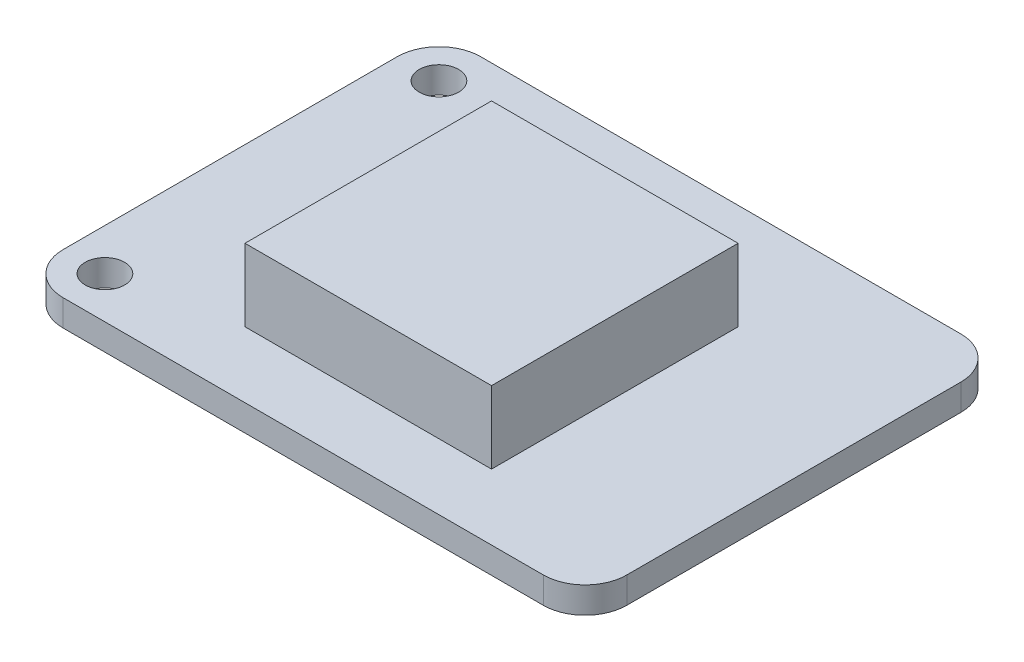
ISO-10303-21;
HEADER;
FILE_DESCRIPTION(('STEP AP214'),'2;1');
FILE_NAME('part.step','',(''),(''),'','','');
FILE_SCHEMA(('AUTOMOTIVE_DESIGN { 1 0 10303 214 1 1 1 1 }'));
ENDSEC;
DATA;
#1=APPLICATION_CONTEXT('core data for automotive mechanical design processes');
#2=APPLICATION_PROTOCOL_DEFINITION('international standard','automotive_design',2000,#1);
#3=PRODUCT_CONTEXT('',#1,'mechanical');
#4=PRODUCT('Part','Part','',(#3));
#5=PRODUCT_RELATED_PRODUCT_CATEGORY('part','',(#4));
#6=PRODUCT_DEFINITION_FORMATION('','',#4);
#7=PRODUCT_DEFINITION_CONTEXT('part definition',#1,'design');
#8=PRODUCT_DEFINITION('design','',#6,#7);
#9=PRODUCT_DEFINITION_SHAPE('','',#8);
#10=(LENGTH_UNIT() NAMED_UNIT(*) SI_UNIT(.MILLI.,.METRE.));
#11=(NAMED_UNIT(*) PLANE_ANGLE_UNIT() SI_UNIT($,.RADIAN.));
#12=(NAMED_UNIT(*) SI_UNIT($,.STERADIAN.) SOLID_ANGLE_UNIT());
#13=UNCERTAINTY_MEASURE_WITH_UNIT(LENGTH_MEASURE(1.E-05),#10,'distance_accuracy_value','');
#14=(GEOMETRIC_REPRESENTATION_CONTEXT(3) GLOBAL_UNCERTAINTY_ASSIGNED_CONTEXT((#13)) GLOBAL_UNIT_ASSIGNED_CONTEXT((#10,
#11,#12)) REPRESENTATION_CONTEXT('',''));
#15=CARTESIAN_POINT('',(0.,0.,0.));
#16=DIRECTION('',(0.,0.,1.));
#17=DIRECTION('',(1.,0.,0.));
#18=AXIS2_PLACEMENT_3D('',#15,#16,#17);
#19=CARTESIAN_POINT('',(14.605,1.6,10.16));
#20=DIRECTION('',(0.,1.,0.));
#21=DIRECTION('',(0.,0.,1.));
#22=AXIS2_PLACEMENT_3D('',#19,#20,#21);
#23=PLANE('',#22);
#24=CARTESIAN_POINT('',(-14.605,1.6,10.16));
#25=DIRECTION('',(0.,1.,0.));
#26=DIRECTION('',(0.,0.,1.));
#27=AXIS2_PLACEMENT_3D('',#24,#25,#26);
#28=CIRCLE('',#27,1.19999999999999);
#29=CARTESIAN_POINT('',(-14.605,1.6,11.36));
#30=VERTEX_POINT('',#29);
#31=EDGE_CURVE('E204',#30,#30,#28,.T.);
#32=ORIENTED_EDGE('',*,*,#31,.F.);
#33=EDGE_LOOP('',(#32));
#34=FACE_BOUND('',#33,.T.);
#35=CARTESIAN_POINT('',(-14.605,1.6,-10.16));
#36=DIRECTION('',(0.,1.,0.));
#37=DIRECTION('',(0.,0.,1.));
#38=AXIS2_PLACEMENT_3D('',#35,#36,#37);
#39=CIRCLE('',#38,1.19999999999999);
#40=CARTESIAN_POINT('',(-14.605,1.6,-8.96000000000001));
#41=VERTEX_POINT('',#40);
#42=EDGE_CURVE('E198',#41,#41,#39,.T.);
#43=ORIENTED_EDGE('',*,*,#42,.F.);
#44=EDGE_LOOP('',(#43));
#45=FACE_BOUND('',#44,.T.);
#46=CARTESIAN_POINT('',(14.605,1.6,10.16));
#47=DIRECTION('',(0.,1.,0.));
#48=DIRECTION('',(0.,0.,1.));
#49=AXIS2_PLACEMENT_3D('',#46,#47,#48);
#50=CIRCLE('',#49,2.54);
#51=CARTESIAN_POINT('',(14.605,1.6,12.7));
#52=VERTEX_POINT('',#51);
#53=CARTESIAN_POINT('',(17.145,1.6,10.16));
#54=VERTEX_POINT('',#53);
#55=EDGE_CURVE('E159',#52,#54,#50,.T.);
#56=ORIENTED_EDGE('',*,*,#55,.T.);
#57=DIRECTION('',(0.,0.,-1.));
#58=VECTOR('',#57,1.);
#59=CARTESIAN_POINT('',(17.145,1.6,10.16));
#60=LINE('',#59,#58);
#61=CARTESIAN_POINT('',(17.145,1.6,-10.16));
#62=VERTEX_POINT('',#61);
#63=EDGE_CURVE('E99',#54,#62,#60,.T.);
#64=ORIENTED_EDGE('',*,*,#63,.T.);
#65=CARTESIAN_POINT('',(14.605,1.6,-10.16));
#66=DIRECTION('',(0.,1.,0.));
#67=DIRECTION('',(0.,0.,-1.));
#68=AXIS2_PLACEMENT_3D('',#65,#66,#67);
#69=CIRCLE('',#68,2.54);
#70=CARTESIAN_POINT('',(14.605,1.6,-12.7));
#71=VERTEX_POINT('',#70);
#72=EDGE_CURVE('E190',#62,#71,#69,.T.);
#73=ORIENTED_EDGE('',*,*,#72,.T.);
#74=DIRECTION('',(-1.,0.,0.));
#75=VECTOR('',#74,1.);
#76=CARTESIAN_POINT('',(-14.605,1.6,-12.7));
#77=LINE('',#76,#75);
#78=CARTESIAN_POINT('',(-14.605,1.6,-12.7));
#79=VERTEX_POINT('',#78);
#80=EDGE_CURVE('E189',#71,#79,#77,.T.);
#81=ORIENTED_EDGE('',*,*,#80,.T.);
#82=CARTESIAN_POINT('',(-14.605,1.6,-10.16));
#83=DIRECTION('',(0.,1.,0.));
#84=DIRECTION('',(0.,0.,-1.));
#85=AXIS2_PLACEMENT_3D('',#82,#83,#84);
#86=CIRCLE('',#85,2.54);
#87=CARTESIAN_POINT('',(-17.145,1.6,-10.16));
#88=VERTEX_POINT('',#87);
#89=EDGE_CURVE('E122',#79,#88,#86,.T.);
#90=ORIENTED_EDGE('',*,*,#89,.T.);
#91=DIRECTION('',(0.,0.,1.));
#92=VECTOR('',#91,1.);
#93=CARTESIAN_POINT('',(-17.145,1.6,10.16));
#94=LINE('',#93,#92);
#95=CARTESIAN_POINT('',(-17.145,1.6,10.16));
#96=VERTEX_POINT('',#95);
#97=EDGE_CURVE('E115',#88,#96,#94,.T.);
#98=ORIENTED_EDGE('',*,*,#97,.T.);
#99=CARTESIAN_POINT('',(-14.605,1.6,10.16));
#100=DIRECTION('',(0.,1.,0.));
#101=DIRECTION('',(0.,0.,-1.));
#102=AXIS2_PLACEMENT_3D('',#99,#100,#101);
#103=CIRCLE('',#102,2.54);
#104=CARTESIAN_POINT('',(-14.605,1.6,12.7));
#105=VERTEX_POINT('',#104);
#106=EDGE_CURVE('E119',#96,#105,#103,.T.);
#107=ORIENTED_EDGE('',*,*,#106,.T.);
#108=DIRECTION('',(1.,0.,0.));
#109=VECTOR('',#108,1.);
#110=CARTESIAN_POINT('',(-14.605,1.6,12.7));
#111=LINE('',#110,#109);
#112=EDGE_CURVE('E57',#105,#52,#111,.T.);
#113=ORIENTED_EDGE('',*,*,#112,.T.);
#114=EDGE_LOOP('',(#56,#64,#73,#81,#90,#98,#107,#113));
#115=FACE_BOUND('',#114,.T.);
#116=DIRECTION('',(1.,0.,0.));
#117=VECTOR('',#116,1.);
#118=CARTESIAN_POINT('',(-7.54500000000001,1.6,8.7));
#119=LINE('',#118,#117);
#120=CARTESIAN_POINT('',(-7.54500000000001,1.6,8.7));
#121=VERTEX_POINT('',#120);
#122=CARTESIAN_POINT('',(7.45499999999999,1.6,8.7));
#123=VERTEX_POINT('',#122);
#124=EDGE_CURVE('E223',#121,#123,#119,.T.);
#125=ORIENTED_EDGE('',*,*,#124,.F.);
#126=DIRECTION('',(0.,0.,1.));
#127=VECTOR('',#126,1.);
#128=CARTESIAN_POINT('',(-7.54500000000001,1.6,8.7));
#129=LINE('',#128,#127);
#130=CARTESIAN_POINT('',(-7.54500000000001,1.6,-6.3));
#131=VERTEX_POINT('',#130);
#132=EDGE_CURVE('E226',#131,#121,#129,.T.);
#133=ORIENTED_EDGE('',*,*,#132,.F.);
#134=DIRECTION('',(-1.,0.,0.));
#135=VECTOR('',#134,1.);
#136=CARTESIAN_POINT('',(-7.54500000000001,1.6,-6.3));
#137=LINE('',#136,#135);
#138=CARTESIAN_POINT('',(7.45499999999999,1.6,-6.3));
#139=VERTEX_POINT('',#138);
#140=EDGE_CURVE('E218',#139,#131,#137,.T.);
#141=ORIENTED_EDGE('',*,*,#140,.F.);
#142=DIRECTION('',(0.,0.,-1.));
#143=VECTOR('',#142,1.);
#144=CARTESIAN_POINT('',(7.45499999999999,1.6,8.7));
#145=LINE('',#144,#143);
#146=EDGE_CURVE('E221',#123,#139,#145,.T.);
#147=ORIENTED_EDGE('',*,*,#146,.F.);
#148=EDGE_LOOP('',(#125,#133,#141,#147));
#149=FACE_BOUND('',#148,.T.);
#150=ADVANCED_FACE('F33',(#34,#45,#115,#149),#23,.T.);
#151=CARTESIAN_POINT('',(14.605,1.6,10.16));
#152=DIRECTION('',(0.,-1.,0.));
#153=DIRECTION('',(0.,0.,-1.));
#154=AXIS2_PLACEMENT_3D('',#151,#152,#153);
#155=CYLINDRICAL_SURFACE('',#154,2.54);
#156=CARTESIAN_POINT('',(14.605,0.,10.16));
#157=DIRECTION('',(0.,1.,0.));
#158=DIRECTION('',(0.,0.,1.));
#159=AXIS2_PLACEMENT_3D('',#156,#157,#158);
#160=CIRCLE('',#159,2.54);
#161=CARTESIAN_POINT('',(14.605,0.,12.7));
#162=VERTEX_POINT('',#161);
#163=CARTESIAN_POINT('',(17.145,0.,10.16));
#164=VERTEX_POINT('',#163);
#165=EDGE_CURVE('E143',#162,#164,#160,.T.);
#166=ORIENTED_EDGE('',*,*,#165,.T.);
#167=DIRECTION('',(0.,-1.,0.));
#168=VECTOR('',#167,1.);
#169=CARTESIAN_POINT('',(17.145,1.6,10.16));
#170=LINE('',#169,#168);
#171=EDGE_CURVE('E41',#54,#164,#170,.T.);
#172=ORIENTED_EDGE('',*,*,#171,.F.);
#173=ORIENTED_EDGE('',*,*,#55,.F.);
#174=DIRECTION('',(0.,-1.,0.));
#175=VECTOR('',#174,1.);
#176=CARTESIAN_POINT('',(14.605,1.6,12.7));
#177=LINE('',#176,#175);
#178=EDGE_CURVE('E139',#52,#162,#177,.T.);
#179=ORIENTED_EDGE('',*,*,#178,.T.);
#180=EDGE_LOOP('',(#166,#172,#173,#179));
#181=FACE_BOUND('',#180,.T.);
#182=ADVANCED_FACE('F35',(#181),#155,.T.);
#183=CARTESIAN_POINT('',(17.145,1.6,10.16));
#184=DIRECTION('',(-1.,0.,0.));
#185=DIRECTION('',(0.,0.,1.));
#186=AXIS2_PLACEMENT_3D('',#183,#184,#185);
#187=PLANE('',#186);
#188=DIRECTION('',(0.,0.,-1.));
#189=VECTOR('',#188,1.);
#190=CARTESIAN_POINT('',(17.145,0.,10.16));
#191=LINE('',#190,#189);
#192=CARTESIAN_POINT('',(17.145,0.,-10.16));
#193=VERTEX_POINT('',#192);
#194=EDGE_CURVE('E146',#164,#193,#191,.T.);
#195=ORIENTED_EDGE('',*,*,#194,.T.);
#196=DIRECTION('',(0.,-1.,0.));
#197=VECTOR('',#196,1.);
#198=CARTESIAN_POINT('',(17.145,1.6,-10.16));
#199=LINE('',#198,#197);
#200=EDGE_CURVE('E169',#62,#193,#199,.T.);
#201=ORIENTED_EDGE('',*,*,#200,.F.);
#202=ORIENTED_EDGE('',*,*,#63,.F.);
#203=ORIENTED_EDGE('',*,*,#171,.T.);
#204=EDGE_LOOP('',(#195,#201,#202,#203));
#205=FACE_BOUND('',#204,.T.);
#206=ADVANCED_FACE('F172',(#205),#187,.F.);
#207=CARTESIAN_POINT('',(14.605,1.6,-10.16));
#208=DIRECTION('',(0.,-1.,0.));
#209=DIRECTION('',(0.,0.,-1.));
#210=AXIS2_PLACEMENT_3D('',#207,#208,#209);
#211=CYLINDRICAL_SURFACE('',#210,2.54);
#212=CARTESIAN_POINT('',(14.605,0.,-10.16));
#213=DIRECTION('',(0.,1.,0.));
#214=DIRECTION('',(0.,0.,-1.));
#215=AXIS2_PLACEMENT_3D('',#212,#213,#214);
#216=CIRCLE('',#215,2.54);
#217=CARTESIAN_POINT('',(14.605,0.,-12.7));
#218=VERTEX_POINT('',#217);
#219=EDGE_CURVE('E149',#193,#218,#216,.T.);
#220=ORIENTED_EDGE('',*,*,#219,.T.);
#221=DIRECTION('',(0.,-1.,0.));
#222=VECTOR('',#221,1.);
#223=CARTESIAN_POINT('',(14.605,1.6,-12.7));
#224=LINE('',#223,#222);
#225=EDGE_CURVE('E166',#71,#218,#224,.T.);
#226=ORIENTED_EDGE('',*,*,#225,.F.);
#227=ORIENTED_EDGE('',*,*,#72,.F.);
#228=ORIENTED_EDGE('',*,*,#200,.T.);
#229=EDGE_LOOP('',(#220,#226,#227,#228));
#230=FACE_BOUND('',#229,.T.);
#231=ADVANCED_FACE('F183',(#230),#211,.T.);
#232=CARTESIAN_POINT('',(-14.605,1.6,-12.7));
#233=DIRECTION('',(0.,0.,1.));
#234=DIRECTION('',(1.,0.,0.));
#235=AXIS2_PLACEMENT_3D('',#232,#233,#234);
#236=PLANE('',#235);
#237=DIRECTION('',(-1.,0.,0.));
#238=VECTOR('',#237,1.);
#239=CARTESIAN_POINT('',(-14.605,0.,-12.7));
#240=LINE('',#239,#238);
#241=CARTESIAN_POINT('',(-14.605,0.,-12.7));
#242=VERTEX_POINT('',#241);
#243=EDGE_CURVE('E151',#218,#242,#240,.T.);
#244=ORIENTED_EDGE('',*,*,#243,.T.);
#245=DIRECTION('',(0.,-1.,0.));
#246=VECTOR('',#245,1.);
#247=CARTESIAN_POINT('',(-14.605,1.6,-12.7));
#248=LINE('',#247,#246);
#249=EDGE_CURVE('E163',#79,#242,#248,.T.);
#250=ORIENTED_EDGE('',*,*,#249,.F.);
#251=ORIENTED_EDGE('',*,*,#80,.F.);
#252=ORIENTED_EDGE('',*,*,#225,.T.);
#253=EDGE_LOOP('',(#244,#250,#251,#252));
#254=FACE_BOUND('',#253,.T.);
#255=ADVANCED_FACE('F187',(#254),#236,.F.);
#256=CARTESIAN_POINT('',(-14.605,1.6,-10.16));
#257=DIRECTION('',(0.,-1.,0.));
#258=DIRECTION('',(0.,0.,-1.));
#259=AXIS2_PLACEMENT_3D('',#256,#257,#258);
#260=CYLINDRICAL_SURFACE('',#259,2.54);
#261=CARTESIAN_POINT('',(-14.605,0.,-10.16));
#262=DIRECTION('',(0.,1.,0.));
#263=DIRECTION('',(0.,0.,-1.));
#264=AXIS2_PLACEMENT_3D('',#261,#262,#263);
#265=CIRCLE('',#264,2.54);
#266=CARTESIAN_POINT('',(-17.145,0.,-10.16));
#267=VERTEX_POINT('',#266);
#268=EDGE_CURVE('E153',#242,#267,#265,.T.);
#269=ORIENTED_EDGE('',*,*,#268,.T.);
#270=DIRECTION('',(0.,-1.,0.));
#271=VECTOR('',#270,1.);
#272=CARTESIAN_POINT('',(-17.145,1.6,-10.16));
#273=LINE('',#272,#271);
#274=EDGE_CURVE('E134',#88,#267,#273,.T.);
#275=ORIENTED_EDGE('',*,*,#274,.F.);
#276=ORIENTED_EDGE('',*,*,#89,.F.);
#277=ORIENTED_EDGE('',*,*,#249,.T.);
#278=EDGE_LOOP('',(#269,#275,#276,#277));
#279=FACE_BOUND('',#278,.T.);
#280=ADVANCED_FACE('F282',(#279),#260,.T.);
#281=CARTESIAN_POINT('',(-17.145,1.6,10.16));
#282=DIRECTION('',(1.,0.,0.));
#283=DIRECTION('',(0.,0.,-1.));
#284=AXIS2_PLACEMENT_3D('',#281,#282,#283);
#285=PLANE('',#284);
#286=DIRECTION('',(0.,0.,1.));
#287=VECTOR('',#286,1.);
#288=CARTESIAN_POINT('',(-17.145,0.,10.16));
#289=LINE('',#288,#287);
#290=CARTESIAN_POINT('',(-17.145,0.,10.16));
#291=VERTEX_POINT('',#290);
#292=EDGE_CURVE('E131',#267,#291,#289,.T.);
#293=ORIENTED_EDGE('',*,*,#292,.T.);
#294=DIRECTION('',(0.,-1.,0.));
#295=VECTOR('',#294,1.);
#296=CARTESIAN_POINT('',(-17.145,1.6,10.16));
#297=LINE('',#296,#295);
#298=EDGE_CURVE('E128',#96,#291,#297,.T.);
#299=ORIENTED_EDGE('',*,*,#298,.F.);
#300=ORIENTED_EDGE('',*,*,#97,.F.);
#301=ORIENTED_EDGE('',*,*,#274,.T.);
#302=EDGE_LOOP('',(#293,#299,#300,#301));
#303=FACE_BOUND('',#302,.T.);
#304=ADVANCED_FACE('F129',(#303),#285,.F.);
#305=CARTESIAN_POINT('',(-14.605,1.6,10.16));
#306=DIRECTION('',(0.,-1.,0.));
#307=DIRECTION('',(0.,0.,-1.));
#308=AXIS2_PLACEMENT_3D('',#305,#306,#307);
#309=CYLINDRICAL_SURFACE('',#308,2.54);
#310=CARTESIAN_POINT('',(-14.605,0.,10.16));
#311=DIRECTION('',(0.,1.,0.));
#312=DIRECTION('',(0.,0.,-1.));
#313=AXIS2_PLACEMENT_3D('',#310,#311,#312);
#314=CIRCLE('',#313,2.54);
#315=CARTESIAN_POINT('',(-14.605,0.,12.7));
#316=VERTEX_POINT('',#315);
#317=EDGE_CURVE('E156',#291,#316,#314,.T.);
#318=ORIENTED_EDGE('',*,*,#317,.T.);
#319=DIRECTION('',(0.,-1.,0.));
#320=VECTOR('',#319,1.);
#321=CARTESIAN_POINT('',(-14.605,1.6,12.7));
#322=LINE('',#321,#320);
#323=EDGE_CURVE('E135',#105,#316,#322,.T.);
#324=ORIENTED_EDGE('',*,*,#323,.F.);
#325=ORIENTED_EDGE('',*,*,#106,.F.);
#326=ORIENTED_EDGE('',*,*,#298,.T.);
#327=EDGE_LOOP('',(#318,#324,#325,#326));
#328=FACE_BOUND('',#327,.T.);
#329=ADVANCED_FACE('F137',(#328),#309,.T.);
#330=CARTESIAN_POINT('',(-14.605,1.6,12.7));
#331=DIRECTION('',(0.,0.,-1.));
#332=DIRECTION('',(-1.,0.,0.));
#333=AXIS2_PLACEMENT_3D('',#330,#331,#332);
#334=PLANE('',#333);
#335=DIRECTION('',(1.,0.,0.));
#336=VECTOR('',#335,1.);
#337=CARTESIAN_POINT('',(-14.605,0.,12.7));
#338=LINE('',#337,#336);
#339=EDGE_CURVE('E90',#316,#162,#338,.T.);
#340=ORIENTED_EDGE('',*,*,#339,.T.);
#341=ORIENTED_EDGE('',*,*,#178,.F.);
#342=ORIENTED_EDGE('',*,*,#112,.F.);
#343=ORIENTED_EDGE('',*,*,#323,.T.);
#344=EDGE_LOOP('',(#340,#341,#342,#343));
#345=FACE_BOUND('',#344,.T.);
#346=ADVANCED_FACE('F255',(#345),#334,.F.);
#347=CARTESIAN_POINT('',(14.605,0.,10.16));
#348=DIRECTION('',(0.,1.,0.));
#349=DIRECTION('',(0.,0.,1.));
#350=AXIS2_PLACEMENT_3D('',#347,#348,#349);
#351=PLANE('',#350);
#352=CARTESIAN_POINT('',(-9.645,0.,0.));
#353=DIRECTION('',(0.,1.,0.));
#354=DIRECTION('',(0.,0.,1.));
#355=AXIS2_PLACEMENT_3D('',#352,#353,#354);
#356=CIRCLE('',#355,6.5);
#357=CARTESIAN_POINT('',(-9.645,0.,6.5));
#358=VERTEX_POINT('',#357);
#359=EDGE_CURVE('E11',#358,#358,#356,.F.);
#360=ORIENTED_EDGE('',*,*,#359,.F.);
#361=EDGE_LOOP('',(#360));
#362=FACE_BOUND('',#361,.T.);
#363=CARTESIAN_POINT('',(-14.605,0.,10.16));
#364=DIRECTION('',(0.,1.,0.));
#365=DIRECTION('',(0.,0.,1.));
#366=AXIS2_PLACEMENT_3D('',#363,#364,#365);
#367=CIRCLE('',#366,1.2);
#368=CARTESIAN_POINT('',(-14.605,0.,11.36));
#369=VERTEX_POINT('',#368);
#370=EDGE_CURVE('E201',#369,#369,#367,.T.);
#371=ORIENTED_EDGE('',*,*,#370,.T.);
#372=EDGE_LOOP('',(#371));
#373=FACE_BOUND('',#372,.T.);
#374=CARTESIAN_POINT('',(-14.605,0.,-10.16));
#375=DIRECTION('',(0.,1.,0.));
#376=DIRECTION('',(0.,0.,1.));
#377=AXIS2_PLACEMENT_3D('',#374,#375,#376);
#378=CIRCLE('',#377,1.2);
#379=CARTESIAN_POINT('',(-14.605,0.,-8.96));
#380=VERTEX_POINT('',#379);
#381=EDGE_CURVE('E147',#380,#380,#378,.T.);
#382=ORIENTED_EDGE('',*,*,#381,.T.);
#383=EDGE_LOOP('',(#382));
#384=FACE_BOUND('',#383,.T.);
#385=ORIENTED_EDGE('',*,*,#165,.F.);
#386=ORIENTED_EDGE('',*,*,#339,.F.);
#387=ORIENTED_EDGE('',*,*,#317,.F.);
#388=ORIENTED_EDGE('',*,*,#292,.F.);
#389=ORIENTED_EDGE('',*,*,#268,.F.);
#390=ORIENTED_EDGE('',*,*,#243,.F.);
#391=ORIENTED_EDGE('',*,*,#219,.F.);
#392=ORIENTED_EDGE('',*,*,#194,.F.);
#393=EDGE_LOOP('',(#385,#386,#387,#388,#389,#390,#391,#392));
#394=FACE_BOUND('',#393,.T.);
#395=ADVANCED_FACE('F177',(#362,#373,#384,#394),#351,.F.);
#396=CARTESIAN_POINT('',(-14.605,1.6,-10.16));
#397=DIRECTION('',(0.,1.,0.));
#398=DIRECTION('',(0.,0.,1.));
#399=AXIS2_PLACEMENT_3D('',#396,#397,#398);
#400=CYLINDRICAL_SURFACE('',#399,1.19999999999999);
#401=ORIENTED_EDGE('',*,*,#381,.F.);
#402=EDGE_LOOP('',(#401));
#403=FACE_BOUND('',#402,.T.);
#404=ORIENTED_EDGE('',*,*,#42,.T.);
#405=EDGE_LOOP('',(#404));
#406=FACE_BOUND('',#405,.T.);
#407=ADVANCED_FACE('F254',(#403,#406),#400,.F.);
#408=CARTESIAN_POINT('',(-14.605,1.6,10.16));
#409=DIRECTION('',(0.,1.,0.));
#410=DIRECTION('',(0.,0.,1.));
#411=AXIS2_PLACEMENT_3D('',#408,#409,#410);
#412=CYLINDRICAL_SURFACE('',#411,1.19999999999999);
#413=ORIENTED_EDGE('',*,*,#370,.F.);
#414=EDGE_LOOP('',(#413));
#415=FACE_BOUND('',#414,.T.);
#416=ORIENTED_EDGE('',*,*,#31,.T.);
#417=EDGE_LOOP('',(#416));
#418=FACE_BOUND('',#417,.T.);
#419=ADVANCED_FACE('F263',(#415,#418),#412,.F.);
#420=CARTESIAN_POINT('',(-7.54500000000001,6.,8.7));
#421=DIRECTION('',(1.,0.,0.));
#422=DIRECTION('',(0.,0.,-1.));
#423=AXIS2_PLACEMENT_3D('',#420,#421,#422);
#424=PLANE('',#423);
#425=ORIENTED_EDGE('',*,*,#132,.T.);
#426=DIRECTION('',(0.,-1.,0.));
#427=VECTOR('',#426,1.);
#428=CARTESIAN_POINT('',(-7.54500000000001,6.,8.7));
#429=LINE('',#428,#427);
#430=CARTESIAN_POINT('',(-7.54500000000001,6.,8.7));
#431=VERTEX_POINT('',#430);
#432=EDGE_CURVE('E207',#431,#121,#429,.T.);
#433=ORIENTED_EDGE('',*,*,#432,.F.);
#434=DIRECTION('',(0.,0.,1.));
#435=VECTOR('',#434,1.);
#436=CARTESIAN_POINT('',(-7.54500000000001,6.,8.7));
#437=LINE('',#436,#435);
#438=CARTESIAN_POINT('',(-7.54500000000001,6.,-6.3));
#439=VERTEX_POINT('',#438);
#440=EDGE_CURVE('E220',#439,#431,#437,.T.);
#441=ORIENTED_EDGE('',*,*,#440,.F.);
#442=DIRECTION('',(0.,-1.,0.));
#443=VECTOR('',#442,1.);
#444=CARTESIAN_POINT('',(-7.54500000000001,6.,-6.3));
#445=LINE('',#444,#443);
#446=EDGE_CURVE('E214',#439,#131,#445,.T.);
#447=ORIENTED_EDGE('',*,*,#446,.T.);
#448=EDGE_LOOP('',(#425,#433,#441,#447));
#449=FACE_BOUND('',#448,.T.);
#450=ADVANCED_FACE('F334',(#449),#424,.F.);
#451=CARTESIAN_POINT('',(-7.54500000000001,6.,8.7));
#452=DIRECTION('',(0.,0.,-1.));
#453=DIRECTION('',(-1.,0.,0.));
#454=AXIS2_PLACEMENT_3D('',#451,#452,#453);
#455=PLANE('',#454);
#456=ORIENTED_EDGE('',*,*,#124,.T.);
#457=DIRECTION('',(0.,-1.,0.));
#458=VECTOR('',#457,1.);
#459=CARTESIAN_POINT('',(7.45499999999999,6.,8.7));
#460=LINE('',#459,#458);
#461=CARTESIAN_POINT('',(7.45499999999999,6.,8.7));
#462=VERTEX_POINT('',#461);
#463=EDGE_CURVE('E210',#462,#123,#460,.T.);
#464=ORIENTED_EDGE('',*,*,#463,.F.);
#465=DIRECTION('',(1.,0.,0.));
#466=VECTOR('',#465,1.);
#467=CARTESIAN_POINT('',(-7.54500000000001,6.,8.7));
#468=LINE('',#467,#466);
#469=EDGE_CURVE('E235',#431,#462,#468,.T.);
#470=ORIENTED_EDGE('',*,*,#469,.F.);
#471=ORIENTED_EDGE('',*,*,#432,.T.);
#472=EDGE_LOOP('',(#456,#464,#470,#471));
#473=FACE_BOUND('',#472,.T.);
#474=ADVANCED_FACE('F341',(#473),#455,.F.);
#475=CARTESIAN_POINT('',(7.45499999999999,6.,8.7));
#476=DIRECTION('',(-1.,0.,0.));
#477=DIRECTION('',(0.,0.,1.));
#478=AXIS2_PLACEMENT_3D('',#475,#476,#477);
#479=PLANE('',#478);
#480=ORIENTED_EDGE('',*,*,#146,.T.);
#481=DIRECTION('',(0.,-1.,0.));
#482=VECTOR('',#481,1.);
#483=CARTESIAN_POINT('',(7.45499999999999,6.,-6.3));
#484=LINE('',#483,#482);
#485=CARTESIAN_POINT('',(7.45499999999999,6.,-6.3));
#486=VERTEX_POINT('',#485);
#487=EDGE_CURVE('E48',#486,#139,#484,.T.);
#488=ORIENTED_EDGE('',*,*,#487,.F.);
#489=DIRECTION('',(0.,0.,-1.));
#490=VECTOR('',#489,1.);
#491=CARTESIAN_POINT('',(7.45499999999999,6.,8.7));
#492=LINE('',#491,#490);
#493=EDGE_CURVE('E232',#462,#486,#492,.T.);
#494=ORIENTED_EDGE('',*,*,#493,.F.);
#495=ORIENTED_EDGE('',*,*,#463,.T.);
#496=EDGE_LOOP('',(#480,#488,#494,#495));
#497=FACE_BOUND('',#496,.T.);
#498=ADVANCED_FACE('F349',(#497),#479,.F.);
#499=CARTESIAN_POINT('',(-7.54500000000001,6.,-6.3));
#500=DIRECTION('',(0.,0.,1.));
#501=DIRECTION('',(1.,0.,0.));
#502=AXIS2_PLACEMENT_3D('',#499,#500,#501);
#503=PLANE('',#502);
#504=ORIENTED_EDGE('',*,*,#140,.T.);
#505=ORIENTED_EDGE('',*,*,#446,.F.);
#506=DIRECTION('',(-1.,0.,0.));
#507=VECTOR('',#506,1.);
#508=CARTESIAN_POINT('',(-7.54500000000001,6.,-6.3));
#509=LINE('',#508,#507);
#510=EDGE_CURVE('E217',#486,#439,#509,.T.);
#511=ORIENTED_EDGE('',*,*,#510,.F.);
#512=ORIENTED_EDGE('',*,*,#487,.T.);
#513=EDGE_LOOP('',(#504,#505,#511,#512));
#514=FACE_BOUND('',#513,.T.);
#515=ADVANCED_FACE('F357',(#514),#503,.F.);
#516=CARTESIAN_POINT('',(0.,6.,0.));
#517=DIRECTION('',(0.,-1.,0.));
#518=DIRECTION('',(0.,0.,-1.));
#519=AXIS2_PLACEMENT_3D('',#516,#517,#518);
#520=PLANE('',#519);
#521=ORIENTED_EDGE('',*,*,#440,.T.);
#522=ORIENTED_EDGE('',*,*,#469,.T.);
#523=ORIENTED_EDGE('',*,*,#493,.T.);
#524=ORIENTED_EDGE('',*,*,#510,.T.);
#525=EDGE_LOOP('',(#521,#522,#523,#524));
#526=FACE_BOUND('',#525,.T.);
#527=ADVANCED_FACE('F248',(#526),#520,.F.);
#528=CARTESIAN_POINT('',(-9.645,-3.5,0.));
#529=DIRECTION('',(0.,1.,0.));
#530=DIRECTION('',(0.,0.,1.));
#531=AXIS2_PLACEMENT_3D('',#528,#529,#530);
#532=CYLINDRICAL_SURFACE('',#531,6.5);
#533=CARTESIAN_POINT('',(-9.645,-3.5,0.));
#534=DIRECTION('',(0.,-1.,0.));
#535=DIRECTION('',(0.,0.,-1.));
#536=AXIS2_PLACEMENT_3D('',#533,#534,#535);
#537=CIRCLE('',#536,6.5);
#538=CARTESIAN_POINT('',(-9.645,-3.5,-6.5));
#539=VERTEX_POINT('',#538);
#540=EDGE_CURVE('E229',#539,#539,#537,.T.);
#541=ORIENTED_EDGE('',*,*,#540,.F.);
#542=EDGE_LOOP('',(#541));
#543=FACE_BOUND('',#542,.T.);
#544=ORIENTED_EDGE('',*,*,#359,.T.);
#545=EDGE_LOOP('',(#544));
#546=FACE_BOUND('',#545,.T.);
#547=ADVANCED_FACE('F245',(#543,#546),#532,.T.);
#548=CARTESIAN_POINT('',(-9.645,-3.5,0.));
#549=DIRECTION('',(0.,-1.,0.));
#550=DIRECTION('',(0.,0.,-1.));
#551=AXIS2_PLACEMENT_3D('',#548,#549,#550);
#552=PLANE('',#551);
#553=ORIENTED_EDGE('',*,*,#540,.T.);
#554=EDGE_LOOP('',(#553));
#555=FACE_BOUND('',#554,.T.);
#556=ADVANCED_FACE('F243',(#555),#552,.T.);
#557=CLOSED_SHELL('',(#150,#182,#206,#231,#255,#280,#304,#329,#346,#395,#407,#419,#450,#474,
#498,#515,#527,#547,#556));
#558=MANIFOLD_SOLID_BREP('B2',#557);
#559=ADVANCED_BREP_SHAPE_REPRESENTATION('',(#18,#558),#14);
#560=SHAPE_DEFINITION_REPRESENTATION(#9,#559);
ENDSEC;
END-ISO-10303-21;
